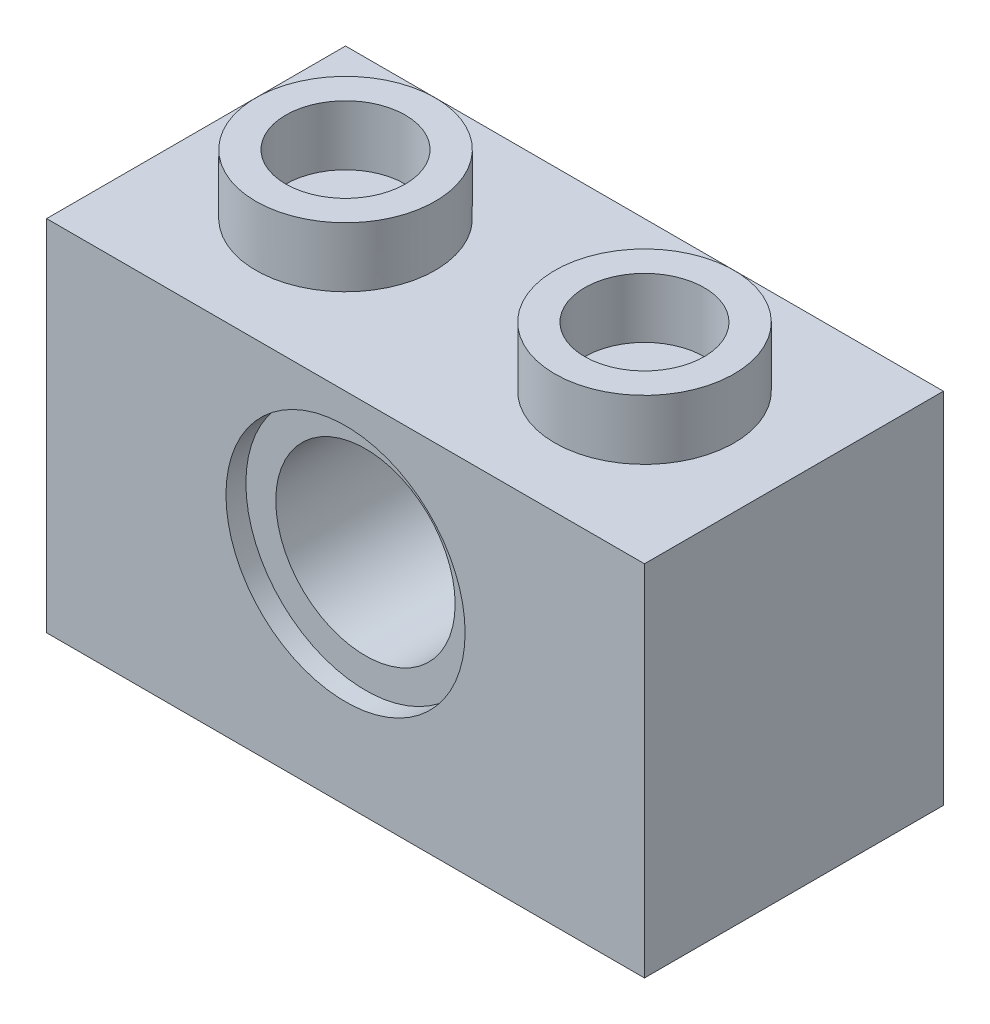
ISO-10303-21;
HEADER;
FILE_DESCRIPTION(('STEP AP214'),'2;1');
FILE_NAME('part.step','',(''),(''),'','','');
FILE_SCHEMA(('AUTOMOTIVE_DESIGN { 1 0 10303 214 1 1 1 1 }'));
ENDSEC;
DATA;
#1=APPLICATION_CONTEXT('core data for automotive mechanical design processes');
#2=APPLICATION_PROTOCOL_DEFINITION('international standard','automotive_design',2000,#1);
#3=PRODUCT_CONTEXT('',#1,'mechanical');
#4=PRODUCT('Part','Part','',(#3));
#5=PRODUCT_RELATED_PRODUCT_CATEGORY('part','',(#4));
#6=PRODUCT_DEFINITION_FORMATION('','',#4);
#7=PRODUCT_DEFINITION_CONTEXT('part definition',#1,'design');
#8=PRODUCT_DEFINITION('design','',#6,#7);
#9=PRODUCT_DEFINITION_SHAPE('','',#8);
#10=(LENGTH_UNIT() NAMED_UNIT(*) SI_UNIT(.MILLI.,.METRE.));
#11=(NAMED_UNIT(*) PLANE_ANGLE_UNIT() SI_UNIT($,.RADIAN.));
#12=(NAMED_UNIT(*) SI_UNIT($,.STERADIAN.) SOLID_ANGLE_UNIT());
#13=UNCERTAINTY_MEASURE_WITH_UNIT(LENGTH_MEASURE(1.E-05),#10,'distance_accuracy_value','');
#14=(GEOMETRIC_REPRESENTATION_CONTEXT(3) GLOBAL_UNCERTAINTY_ASSIGNED_CONTEXT((#13)) GLOBAL_UNIT_ASSIGNED_CONTEXT((#10,
#11,#12)) REPRESENTATION_CONTEXT('',''));
#15=CARTESIAN_POINT('',(0.,0.,0.));
#16=DIRECTION('',(0.,0.,1.));
#17=DIRECTION('',(1.,0.,0.));
#18=AXIS2_PLACEMENT_3D('',#15,#16,#17);
#19=CARTESIAN_POINT('',(5.,3.5,4.24264068711929));
#20=DIRECTION('',(0.,0.,-1.));
#21=DIRECTION('',(-1.,0.,0.));
#22=AXIS2_PLACEMENT_3D('',#19,#20,#21);
#23=CYLINDRICAL_SURFACE('',#22,1.5);
#24=CARTESIAN_POINT('',(5.,3.5,-4.66666666666667));
#25=DIRECTION('',(0.,0.,-1.));
#26=DIRECTION('',(-1.,0.,0.));
#27=AXIS2_PLACEMENT_3D('',#24,#25,#26);
#28=CIRCLE('',#27,1.5);
#29=CARTESIAN_POINT('',(3.5,3.5,-4.66666666666667));
#30=VERTEX_POINT('',#29);
#31=EDGE_CURVE('E192',#30,#30,#28,.T.);
#32=ORIENTED_EDGE('',*,*,#31,.T.);
#33=EDGE_LOOP('',(#32));
#34=FACE_BOUND('',#33,.T.);
#35=CARTESIAN_POINT('',(5.,3.5,-0.333333333333333));
#36=DIRECTION('',(0.,0.,1.));
#37=DIRECTION('',(1.,0.,0.));
#38=AXIS2_PLACEMENT_3D('',#35,#36,#37);
#39=CIRCLE('',#38,1.5);
#40=CARTESIAN_POINT('',(6.5,3.5,-0.333333333333333));
#41=VERTEX_POINT('',#40);
#42=EDGE_CURVE('E39',#41,#41,#39,.F.);
#43=ORIENTED_EDGE('',*,*,#42,.F.);
#44=EDGE_LOOP('',(#43));
#45=FACE_BOUND('',#44,.T.);
#46=ADVANCED_FACE('F35',(#34,#45),#23,.F.);
#47=CARTESIAN_POINT('',(500000.,5.,-4.));
#48=DIRECTION('',(0.,1.,0.));
#49=DIRECTION('',(0.,0.,1.));
#50=AXIS2_PLACEMENT_3D('',#47,#48,#49);
#51=PLANE('',#50);
#52=DIRECTION('',(-1.,0.,0.));
#53=VECTOR('',#52,1.);
#54=CARTESIAN_POINT('',(500000.,5.,-1.));
#55=LINE('',#54,#53);
#56=CARTESIAN_POINT('',(9.00000000001455,5.,-1.));
#57=VERTEX_POINT('',#56);
#58=CARTESIAN_POINT('',(6.3228756555323,5.,-1.));
#59=VERTEX_POINT('',#58);
#60=EDGE_CURVE('E129',#57,#59,#55,.T.);
#61=ORIENTED_EDGE('',*,*,#60,.T.);
#62=DIRECTION('',(0.,0.,-1.));
#63=VECTOR('',#62,1.);
#64=CARTESIAN_POINT('',(6.3228756555323,5.,5.65685424949238));
#65=LINE('',#64,#63);
#66=CARTESIAN_POINT('',(6.3228756555323,5.,-4.));
#67=VERTEX_POINT('',#66);
#68=EDGE_CURVE('E244',#59,#67,#65,.T.);
#69=ORIENTED_EDGE('',*,*,#68,.T.);
#70=DIRECTION('',(-1.,0.,0.));
#71=VECTOR('',#70,1.);
#72=CARTESIAN_POINT('',(500000.,5.,-4.));
#73=LINE('',#72,#71);
#74=CARTESIAN_POINT('',(9.00000000001455,5.,-4.));
#75=VERTEX_POINT('',#74);
#76=EDGE_CURVE('E123',#75,#67,#73,.T.);
#77=ORIENTED_EDGE('',*,*,#76,.F.);
#78=DIRECTION('',(0.,0.,1.));
#79=VECTOR('',#78,1.);
#80=CARTESIAN_POINT('',(9.00000000001455,5.,-4.));
#81=LINE('',#80,#79);
#82=EDGE_CURVE('E267',#75,#57,#81,.T.);
#83=ORIENTED_EDGE('',*,*,#82,.T.);
#84=EDGE_LOOP('',(#61,#69,#77,#83));
#85=FACE_BOUND('',#84,.T.);
#86=ADVANCED_FACE('F204',(#85),#51,.F.);
#87=CARTESIAN_POINT('',(0.,6.,0.));
#88=DIRECTION('',(0.,-1.,0.));
#89=DIRECTION('',(0.,0.,-1.));
#90=AXIS2_PLACEMENT_3D('',#87,#88,#89);
#91=PLANE('',#90);
#92=DIRECTION('',(0.,0.,1.));
#93=VECTOR('',#92,1.);
#94=CARTESIAN_POINT('',(0.,6.,0.));
#95=LINE('',#94,#93);
#96=CARTESIAN_POINT('',(0.,6.,-5.));
#97=VERTEX_POINT('',#96);
#98=CARTESIAN_POINT('',(0.,6.,0.));
#99=VERTEX_POINT('',#98);
#100=EDGE_CURVE('E157',#97,#99,#95,.T.);
#101=ORIENTED_EDGE('',*,*,#100,.T.);
#102=DIRECTION('',(1.,0.,0.));
#103=VECTOR('',#102,1.);
#104=CARTESIAN_POINT('',(0.,6.,0.));
#105=LINE('',#104,#103);
#106=CARTESIAN_POINT('',(10.,6.,0.));
#107=VERTEX_POINT('',#106);
#108=EDGE_CURVE('E160',#99,#107,#105,.T.);
#109=ORIENTED_EDGE('',*,*,#108,.T.);
#110=DIRECTION('',(0.,0.,-1.));
#111=VECTOR('',#110,1.);
#112=CARTESIAN_POINT('',(10.,6.,0.));
#113=LINE('',#112,#111);
#114=CARTESIAN_POINT('',(10.,6.,-5.));
#115=VERTEX_POINT('',#114);
#116=EDGE_CURVE('E163',#107,#115,#113,.T.);
#117=ORIENTED_EDGE('',*,*,#116,.T.);
#118=DIRECTION('',(-1.,0.,0.));
#119=VECTOR('',#118,1.);
#120=CARTESIAN_POINT('',(0.,6.,-5.));
#121=LINE('',#120,#119);
#122=EDGE_CURVE('E165',#115,#97,#121,.T.);
#123=ORIENTED_EDGE('',*,*,#122,.T.);
#124=EDGE_LOOP('',(#101,#109,#117,#123));
#125=FACE_BOUND('',#124,.T.);
#126=CARTESIAN_POINT('',(2.5,6.,-2.5));
#127=DIRECTION('',(0.,-1.,0.));
#128=DIRECTION('',(0.,0.,-1.));
#129=AXIS2_PLACEMENT_3D('',#126,#127,#128);
#130=CIRCLE('',#129,1.5);
#131=CARTESIAN_POINT('',(2.5,6.,-4.));
#132=VERTEX_POINT('',#131);
#133=EDGE_CURVE('E44',#132,#132,#130,.F.);
#134=ORIENTED_EDGE('',*,*,#133,.F.);
#135=EDGE_LOOP('',(#134));
#136=FACE_BOUND('',#135,.T.);
#137=CARTESIAN_POINT('',(7.5,6.,-2.5));
#138=DIRECTION('',(0.,1.,0.));
#139=DIRECTION('',(0.,0.,1.));
#140=AXIS2_PLACEMENT_3D('',#137,#138,#139);
#141=CIRCLE('',#140,1.5);
#142=CARTESIAN_POINT('',(7.5,6.,-1.));
#143=VERTEX_POINT('',#142);
#144=EDGE_CURVE('E249',#143,#143,#141,.F.);
#145=ORIENTED_EDGE('',*,*,#144,.T.);
#146=EDGE_LOOP('',(#145));
#147=FACE_BOUND('',#146,.T.);
#148=ADVANCED_FACE('F297',(#125,#136,#147),#91,.F.);
#149=CARTESIAN_POINT('',(1.,6.,-4.));
#150=DIRECTION('',(1.,0.,0.));
#151=DIRECTION('',(0.,0.,-1.));
#152=AXIS2_PLACEMENT_3D('',#149,#150,#151);
#153=PLANE('',#152);
#154=DIRECTION('',(0.,-1.,0.));
#155=VECTOR('',#154,1.);
#156=CARTESIAN_POINT('',(1.,6.,-4.));
#157=LINE('',#156,#155);
#158=CARTESIAN_POINT('',(1.,5.,-4.));
#159=VERTEX_POINT('',#158);
#160=CARTESIAN_POINT('',(1.,0.,-4.));
#161=VERTEX_POINT('',#160);
#162=EDGE_CURVE('E148',#159,#161,#157,.T.);
#163=ORIENTED_EDGE('',*,*,#162,.F.);
#164=DIRECTION('',(0.,0.,-1.));
#165=VECTOR('',#164,1.);
#166=CARTESIAN_POINT('',(1.,5.,-4.));
#167=LINE('',#166,#165);
#168=CARTESIAN_POINT('',(1.,5.,-1.));
#169=VERTEX_POINT('',#168);
#170=EDGE_CURVE('E127',#169,#159,#167,.T.);
#171=ORIENTED_EDGE('',*,*,#170,.F.);
#172=DIRECTION('',(0.,-1.,0.));
#173=VECTOR('',#172,1.);
#174=CARTESIAN_POINT('',(1.,6.,-1.));
#175=LINE('',#174,#173);
#176=CARTESIAN_POINT('',(1.,0.,-1.));
#177=VERTEX_POINT('',#176);
#178=EDGE_CURVE('E154',#169,#177,#175,.T.);
#179=ORIENTED_EDGE('',*,*,#178,.T.);
#180=DIRECTION('',(0.,0.,1.));
#181=VECTOR('',#180,1.);
#182=CARTESIAN_POINT('',(1.,0.,-4.));
#183=LINE('',#182,#181);
#184=EDGE_CURVE('E136',#161,#177,#183,.T.);
#185=ORIENTED_EDGE('',*,*,#184,.F.);
#186=EDGE_LOOP('',(#163,#171,#179,#185));
#187=FACE_BOUND('',#186,.T.);
#188=ADVANCED_FACE('F274',(#187),#153,.T.);
#189=CARTESIAN_POINT('',(1.,6.,-1.));
#190=DIRECTION('',(0.,0.,-1.));
#191=DIRECTION('',(-1.,0.,0.));
#192=AXIS2_PLACEMENT_3D('',#189,#190,#191);
#193=PLANE('',#192);
#194=CARTESIAN_POINT('',(5.,3.5,-1.));
#195=DIRECTION('',(0.,0.,-1.));
#196=DIRECTION('',(-1.,0.,0.));
#197=AXIS2_PLACEMENT_3D('',#194,#195,#196);
#198=CIRCLE('',#197,2.);
#199=CARTESIAN_POINT('',(3.67712434444911,5.,-1.));
#200=VERTEX_POINT('',#199);
#201=EDGE_CURVE('E52',#59,#200,#198,.T.);
#202=ORIENTED_EDGE('',*,*,#201,.F.);
#203=ORIENTED_EDGE('',*,*,#60,.F.);
#204=DIRECTION('',(0.,-1.,0.));
#205=VECTOR('',#204,1.);
#206=CARTESIAN_POINT('',(9.,6.,-1.));
#207=LINE('',#206,#205);
#208=CARTESIAN_POINT('',(9.,0.,-1.));
#209=VERTEX_POINT('',#208);
#210=EDGE_CURVE('E152',#57,#209,#207,.T.);
#211=ORIENTED_EDGE('',*,*,#210,.T.);
#212=DIRECTION('',(1.,0.,0.));
#213=VECTOR('',#212,1.);
#214=CARTESIAN_POINT('',(1.,0.,-1.));
#215=LINE('',#214,#213);
#216=EDGE_CURVE('E139',#177,#209,#215,.T.);
#217=ORIENTED_EDGE('',*,*,#216,.F.);
#218=ORIENTED_EDGE('',*,*,#178,.F.);
#219=EDGE_CURVE('E132',#200,#169,#55,.T.);
#220=ORIENTED_EDGE('',*,*,#219,.F.);
#221=EDGE_LOOP('',(#202,#203,#211,#217,#218,#220));
#222=FACE_BOUND('',#221,.T.);
#223=ADVANCED_FACE('F277',(#222),#193,.T.);
#224=CARTESIAN_POINT('',(9.,6.,-4.));
#225=DIRECTION('',(-1.,0.,0.));
#226=DIRECTION('',(0.,0.,1.));
#227=AXIS2_PLACEMENT_3D('',#224,#225,#226);
#228=PLANE('',#227);
#229=ORIENTED_EDGE('',*,*,#210,.F.);
#230=ORIENTED_EDGE('',*,*,#82,.F.);
#231=DIRECTION('',(0.,-1.,0.));
#232=VECTOR('',#231,1.);
#233=CARTESIAN_POINT('',(9.,6.,-4.));
#234=LINE('',#233,#232);
#235=CARTESIAN_POINT('',(9.,0.,-4.));
#236=VERTEX_POINT('',#235);
#237=EDGE_CURVE('E150',#75,#236,#234,.T.);
#238=ORIENTED_EDGE('',*,*,#237,.T.);
#239=DIRECTION('',(0.,0.,-1.));
#240=VECTOR('',#239,1.);
#241=CARTESIAN_POINT('',(9.,0.,-4.));
#242=LINE('',#241,#240);
#243=EDGE_CURVE('E142',#209,#236,#242,.T.);
#244=ORIENTED_EDGE('',*,*,#243,.F.);
#245=EDGE_LOOP('',(#229,#230,#238,#244));
#246=FACE_BOUND('',#245,.T.);
#247=ADVANCED_FACE('F284',(#246),#228,.T.);
#248=CARTESIAN_POINT('',(1.,6.,-4.));
#249=DIRECTION('',(0.,0.,1.));
#250=DIRECTION('',(1.,0.,0.));
#251=AXIS2_PLACEMENT_3D('',#248,#249,#250);
#252=PLANE('',#251);
#253=CARTESIAN_POINT('',(5.,3.5,-4.));
#254=DIRECTION('',(0.,0.,1.));
#255=DIRECTION('',(1.,0.,0.));
#256=AXIS2_PLACEMENT_3D('',#253,#254,#255);
#257=CIRCLE('',#256,2.);
#258=CARTESIAN_POINT('',(3.6771243444677,5.,-4.));
#259=VERTEX_POINT('',#258);
#260=EDGE_CURVE('E114',#259,#67,#257,.T.);
#261=ORIENTED_EDGE('',*,*,#260,.F.);
#262=EDGE_CURVE('E60',#259,#159,#73,.T.);
#263=ORIENTED_EDGE('',*,*,#262,.T.);
#264=ORIENTED_EDGE('',*,*,#162,.T.);
#265=DIRECTION('',(-1.,0.,0.));
#266=VECTOR('',#265,1.);
#267=CARTESIAN_POINT('',(1.,0.,-4.));
#268=LINE('',#267,#266);
#269=EDGE_CURVE('E145',#236,#161,#268,.T.);
#270=ORIENTED_EDGE('',*,*,#269,.F.);
#271=ORIENTED_EDGE('',*,*,#237,.F.);
#272=ORIENTED_EDGE('',*,*,#76,.T.);
#273=EDGE_LOOP('',(#261,#263,#264,#270,#271,#272));
#274=FACE_BOUND('',#273,.T.);
#275=ADVANCED_FACE('F121',(#274),#252,.T.);
#276=CARTESIAN_POINT('',(0.,0.,0.));
#277=DIRECTION('',(0.,-1.,0.));
#278=DIRECTION('',(0.,0.,-1.));
#279=AXIS2_PLACEMENT_3D('',#276,#277,#278);
#280=PLANE('',#279);
#281=DIRECTION('',(0.,0.,1.));
#282=VECTOR('',#281,1.);
#283=CARTESIAN_POINT('',(0.,0.,0.));
#284=LINE('',#283,#282);
#285=CARTESIAN_POINT('',(0.,0.,-5.));
#286=VERTEX_POINT('',#285);
#287=CARTESIAN_POINT('',(0.,0.,0.));
#288=VERTEX_POINT('',#287);
#289=EDGE_CURVE('E156',#286,#288,#284,.T.);
#290=ORIENTED_EDGE('',*,*,#289,.F.);
#291=DIRECTION('',(-1.,0.,0.));
#292=VECTOR('',#291,1.);
#293=CARTESIAN_POINT('',(0.,0.,-5.));
#294=LINE('',#293,#292);
#295=CARTESIAN_POINT('',(10.,0.,-5.));
#296=VERTEX_POINT('',#295);
#297=EDGE_CURVE('E161',#296,#286,#294,.T.);
#298=ORIENTED_EDGE('',*,*,#297,.F.);
#299=DIRECTION('',(0.,0.,-1.));
#300=VECTOR('',#299,1.);
#301=CARTESIAN_POINT('',(10.,0.,0.));
#302=LINE('',#301,#300);
#303=CARTESIAN_POINT('',(10.,0.,0.));
#304=VERTEX_POINT('',#303);
#305=EDGE_CURVE('E172',#304,#296,#302,.T.);
#306=ORIENTED_EDGE('',*,*,#305,.F.);
#307=DIRECTION('',(1.,0.,0.));
#308=VECTOR('',#307,1.);
#309=CARTESIAN_POINT('',(0.,0.,0.));
#310=LINE('',#309,#308);
#311=EDGE_CURVE('E170',#288,#304,#310,.T.);
#312=ORIENTED_EDGE('',*,*,#311,.F.);
#313=EDGE_LOOP('',(#290,#298,#306,#312));
#314=FACE_BOUND('',#313,.T.);
#315=ORIENTED_EDGE('',*,*,#269,.T.);
#316=ORIENTED_EDGE('',*,*,#184,.T.);
#317=ORIENTED_EDGE('',*,*,#216,.T.);
#318=ORIENTED_EDGE('',*,*,#243,.T.);
#319=EDGE_LOOP('',(#315,#316,#317,#318));
#320=FACE_BOUND('',#319,.T.);
#321=ADVANCED_FACE('F281',(#314,#320),#280,.T.);
#322=CARTESIAN_POINT('',(0.,6.,0.));
#323=DIRECTION('',(1.,0.,0.));
#324=DIRECTION('',(0.,0.,-1.));
#325=AXIS2_PLACEMENT_3D('',#322,#323,#324);
#326=PLANE('',#325);
#327=ORIENTED_EDGE('',*,*,#289,.T.);
#328=DIRECTION('',(0.,-1.,0.));
#329=VECTOR('',#328,1.);
#330=CARTESIAN_POINT('',(0.,6.,0.));
#331=LINE('',#330,#329);
#332=EDGE_CURVE('E183',#99,#288,#331,.T.);
#333=ORIENTED_EDGE('',*,*,#332,.F.);
#334=ORIENTED_EDGE('',*,*,#100,.F.);
#335=DIRECTION('',(0.,-1.,0.));
#336=VECTOR('',#335,1.);
#337=CARTESIAN_POINT('',(0.,6.,-5.));
#338=LINE('',#337,#336);
#339=EDGE_CURVE('E167',#97,#286,#338,.T.);
#340=ORIENTED_EDGE('',*,*,#339,.T.);
#341=EDGE_LOOP('',(#327,#333,#334,#340));
#342=FACE_BOUND('',#341,.T.);
#343=ADVANCED_FACE('F37',(#342),#326,.F.);
#344=CARTESIAN_POINT('',(0.,6.,0.));
#345=DIRECTION('',(0.,0.,-1.));
#346=DIRECTION('',(-1.,0.,0.));
#347=AXIS2_PLACEMENT_3D('',#344,#345,#346);
#348=PLANE('',#347);
#349=CARTESIAN_POINT('',(5.,3.5,0.));
#350=DIRECTION('',(0.,0.,1.));
#351=DIRECTION('',(1.,0.,0.));
#352=AXIS2_PLACEMENT_3D('',#349,#350,#351);
#353=CIRCLE('',#352,2.);
#354=CARTESIAN_POINT('',(7.,3.5,0.));
#355=VERTEX_POINT('',#354);
#356=EDGE_CURVE('E234',#355,#355,#353,.T.);
#357=ORIENTED_EDGE('',*,*,#356,.F.);
#358=EDGE_LOOP('',(#357));
#359=FACE_BOUND('',#358,.T.);
#360=ORIENTED_EDGE('',*,*,#311,.T.);
#361=DIRECTION('',(0.,-1.,0.));
#362=VECTOR('',#361,1.);
#363=CARTESIAN_POINT('',(10.,6.,0.));
#364=LINE('',#363,#362);
#365=EDGE_CURVE('E180',#107,#304,#364,.T.);
#366=ORIENTED_EDGE('',*,*,#365,.F.);
#367=ORIENTED_EDGE('',*,*,#108,.F.);
#368=ORIENTED_EDGE('',*,*,#332,.T.);
#369=EDGE_LOOP('',(#360,#366,#367,#368));
#370=FACE_BOUND('',#369,.T.);
#371=ADVANCED_FACE('F311',(#359,#370),#348,.F.);
#372=CARTESIAN_POINT('',(10.,6.,0.));
#373=DIRECTION('',(-1.,0.,0.));
#374=DIRECTION('',(0.,0.,1.));
#375=AXIS2_PLACEMENT_3D('',#372,#373,#374);
#376=PLANE('',#375);
#377=ORIENTED_EDGE('',*,*,#305,.T.);
#378=DIRECTION('',(0.,-1.,0.));
#379=VECTOR('',#378,1.);
#380=CARTESIAN_POINT('',(10.,6.,-5.));
#381=LINE('',#380,#379);
#382=EDGE_CURVE('E177',#115,#296,#381,.T.);
#383=ORIENTED_EDGE('',*,*,#382,.F.);
#384=ORIENTED_EDGE('',*,*,#116,.F.);
#385=ORIENTED_EDGE('',*,*,#365,.T.);
#386=EDGE_LOOP('',(#377,#383,#384,#385));
#387=FACE_BOUND('',#386,.T.);
#388=ADVANCED_FACE('F308',(#387),#376,.F.);
#389=CARTESIAN_POINT('',(0.,6.,-5.));
#390=DIRECTION('',(0.,0.,1.));
#391=DIRECTION('',(1.,0.,0.));
#392=AXIS2_PLACEMENT_3D('',#389,#390,#391);
#393=PLANE('',#392);
#394=CARTESIAN_POINT('',(5.,3.5,-5.));
#395=DIRECTION('',(0.,0.,-1.));
#396=DIRECTION('',(-1.,0.,0.));
#397=AXIS2_PLACEMENT_3D('',#394,#395,#396);
#398=CIRCLE('',#397,2.);
#399=CARTESIAN_POINT('',(3.,3.5,-5.));
#400=VERTEX_POINT('',#399);
#401=EDGE_CURVE('E230',#400,#400,#398,.T.);
#402=ORIENTED_EDGE('',*,*,#401,.F.);
#403=EDGE_LOOP('',(#402));
#404=FACE_BOUND('',#403,.T.);
#405=ORIENTED_EDGE('',*,*,#297,.T.);
#406=ORIENTED_EDGE('',*,*,#339,.F.);
#407=ORIENTED_EDGE('',*,*,#122,.F.);
#408=ORIENTED_EDGE('',*,*,#382,.T.);
#409=EDGE_LOOP('',(#405,#406,#407,#408));
#410=FACE_BOUND('',#409,.T.);
#411=ADVANCED_FACE('F305',(#404,#410),#393,.F.);
#412=ORIENTED_EDGE('',*,*,#262,.F.);
#413=DIRECTION('',(0.,0.,-1.));
#414=VECTOR('',#413,1.);
#415=CARTESIAN_POINT('',(3.6771243444677,5.,5.65685424949238));
#416=LINE('',#415,#414);
#417=EDGE_CURVE('E112',#259,#200,#416,.F.);
#418=ORIENTED_EDGE('',*,*,#417,.T.);
#419=ORIENTED_EDGE('',*,*,#219,.T.);
#420=ORIENTED_EDGE('',*,*,#170,.T.);
#421=EDGE_LOOP('',(#412,#418,#419,#420));
#422=FACE_BOUND('',#421,.T.);
#423=ADVANCED_FACE('F125',(#422),#51,.F.);
#424=CARTESIAN_POINT('',(2.5,7.,-2.5));
#425=DIRECTION('',(0.,-1.,0.));
#426=DIRECTION('',(0.,0.,-1.));
#427=AXIS2_PLACEMENT_3D('',#424,#425,#426);
#428=CYLINDRICAL_SURFACE('',#427,1.);
#429=CARTESIAN_POINT('',(2.5,7.,-2.5));
#430=DIRECTION('',(0.,1.,0.));
#431=DIRECTION('',(0.,0.,1.));
#432=AXIS2_PLACEMENT_3D('',#429,#430,#431);
#433=CIRCLE('',#432,1.);
#434=CARTESIAN_POINT('',(2.5,7.,-1.5));
#435=VERTEX_POINT('',#434);
#436=EDGE_CURVE('E257',#435,#435,#433,.F.);
#437=ORIENTED_EDGE('',*,*,#436,.F.);
#438=EDGE_LOOP('',(#437));
#439=FACE_BOUND('',#438,.T.);
#440=CARTESIAN_POINT('',(2.5,6.,-2.5));
#441=DIRECTION('',(0.,-1.,0.));
#442=DIRECTION('',(0.,0.,-1.));
#443=AXIS2_PLACEMENT_3D('',#440,#441,#442);
#444=CIRCLE('',#443,1.);
#445=CARTESIAN_POINT('',(2.5,6.,-3.5));
#446=VERTEX_POINT('',#445);
#447=EDGE_CURVE('E11',#446,#446,#444,.T.);
#448=ORIENTED_EDGE('',*,*,#447,.T.);
#449=EDGE_LOOP('',(#448));
#450=FACE_BOUND('',#449,.T.);
#451=ADVANCED_FACE('F359',(#439,#450),#428,.F.);
#452=CARTESIAN_POINT('',(2.5,7.,-2.5));
#453=DIRECTION('',(0.,-1.,0.));
#454=DIRECTION('',(0.,0.,-1.));
#455=AXIS2_PLACEMENT_3D('',#452,#453,#454);
#456=CYLINDRICAL_SURFACE('',#455,1.5);
#457=CARTESIAN_POINT('',(2.5,7.,-2.5));
#458=DIRECTION('',(0.,1.,0.));
#459=DIRECTION('',(0.,0.,1.));
#460=AXIS2_PLACEMENT_3D('',#457,#458,#459);
#461=CIRCLE('',#460,1.5);
#462=CARTESIAN_POINT('',(2.5,7.,-1.));
#463=VERTEX_POINT('',#462);
#464=EDGE_CURVE('E264',#463,#463,#461,.T.);
#465=ORIENTED_EDGE('',*,*,#464,.F.);
#466=EDGE_LOOP('',(#465));
#467=FACE_BOUND('',#466,.T.);
#468=ORIENTED_EDGE('',*,*,#133,.T.);
#469=EDGE_LOOP('',(#468));
#470=FACE_BOUND('',#469,.T.);
#471=ADVANCED_FACE('F355',(#467,#470),#456,.T.);
#472=CARTESIAN_POINT('',(0.,7.,0.));
#473=DIRECTION('',(0.,1.,0.));
#474=DIRECTION('',(0.,0.,1.));
#475=AXIS2_PLACEMENT_3D('',#472,#473,#474);
#476=PLANE('',#475);
#477=ORIENTED_EDGE('',*,*,#436,.T.);
#478=EDGE_LOOP('',(#477));
#479=FACE_BOUND('',#478,.T.);
#480=ORIENTED_EDGE('',*,*,#464,.T.);
#481=EDGE_LOOP('',(#480));
#482=FACE_BOUND('',#481,.T.);
#483=ADVANCED_FACE('F349',(#479,#482),#476,.T.);
#484=ORIENTED_EDGE('',*,*,#447,.F.);
#485=EDGE_LOOP('',(#484));
#486=FACE_BOUND('',#485,.T.);
#487=ADVANCED_FACE('F301',(#486),#91,.F.);
#488=CARTESIAN_POINT('',(7.5,7.,-2.5));
#489=DIRECTION('',(0.,-1.,0.));
#490=DIRECTION('',(0.,0.,-1.));
#491=AXIS2_PLACEMENT_3D('',#488,#489,#490);
#492=CYLINDRICAL_SURFACE('',#491,1.5);
#493=CARTESIAN_POINT('',(7.5,7.,-2.5));
#494=DIRECTION('',(0.,1.,0.));
#495=DIRECTION('',(0.,0.,1.));
#496=AXIS2_PLACEMENT_3D('',#493,#494,#495);
#497=CIRCLE('',#496,1.5);
#498=CARTESIAN_POINT('',(7.5,7.,-1.));
#499=VERTEX_POINT('',#498);
#500=EDGE_CURVE('E250',#499,#499,#497,.F.);
#501=ORIENTED_EDGE('',*,*,#500,.T.);
#502=EDGE_LOOP('',(#501));
#503=FACE_BOUND('',#502,.T.);
#504=ORIENTED_EDGE('',*,*,#144,.F.);
#505=EDGE_LOOP('',(#504));
#506=FACE_BOUND('',#505,.T.);
#507=ADVANCED_FACE('F337',(#503,#506),#492,.T.);
#508=CARTESIAN_POINT('',(7.5,7.,-2.5));
#509=DIRECTION('',(0.,-1.,0.));
#510=DIRECTION('',(0.,0.,-1.));
#511=AXIS2_PLACEMENT_3D('',#508,#509,#510);
#512=CYLINDRICAL_SURFACE('',#511,1.);
#513=CARTESIAN_POINT('',(7.5,7.,-2.5));
#514=DIRECTION('',(0.,1.,0.));
#515=DIRECTION('',(0.,0.,1.));
#516=AXIS2_PLACEMENT_3D('',#513,#514,#515);
#517=CIRCLE('',#516,1.);
#518=CARTESIAN_POINT('',(7.5,7.,-1.5));
#519=VERTEX_POINT('',#518);
#520=EDGE_CURVE('E253',#519,#519,#517,.T.);
#521=ORIENTED_EDGE('',*,*,#520,.T.);
#522=EDGE_LOOP('',(#521));
#523=FACE_BOUND('',#522,.T.);
#524=CARTESIAN_POINT('',(7.5,6.,-2.5));
#525=DIRECTION('',(0.,1.,0.));
#526=DIRECTION('',(0.,0.,1.));
#527=AXIS2_PLACEMENT_3D('',#524,#525,#526);
#528=CIRCLE('',#527,1.);
#529=CARTESIAN_POINT('',(7.5,6.,-1.5));
#530=VERTEX_POINT('',#529);
#531=EDGE_CURVE('E254',#530,#530,#528,.T.);
#532=ORIENTED_EDGE('',*,*,#531,.F.);
#533=EDGE_LOOP('',(#532));
#534=FACE_BOUND('',#533,.T.);
#535=ADVANCED_FACE('F339',(#523,#534),#512,.F.);
#536=CARTESIAN_POINT('',(0.,7.,0.));
#537=DIRECTION('',(0.,1.,0.));
#538=DIRECTION('',(0.,0.,1.));
#539=AXIS2_PLACEMENT_3D('',#536,#537,#538);
#540=PLANE('',#539);
#541=ORIENTED_EDGE('',*,*,#500,.F.);
#542=EDGE_LOOP('',(#541));
#543=FACE_BOUND('',#542,.T.);
#544=ORIENTED_EDGE('',*,*,#520,.F.);
#545=EDGE_LOOP('',(#544));
#546=FACE_BOUND('',#545,.T.);
#547=ADVANCED_FACE('F346',(#543,#546),#540,.T.);
#548=ORIENTED_EDGE('',*,*,#531,.T.);
#549=EDGE_LOOP('',(#548));
#550=FACE_BOUND('',#549,.T.);
#551=ADVANCED_FACE('F200',(#550),#91,.F.);
#552=CARTESIAN_POINT('',(5.,3.5,5.65685424949238));
#553=DIRECTION('',(0.,0.,-1.));
#554=DIRECTION('',(-1.,0.,0.));
#555=AXIS2_PLACEMENT_3D('',#552,#553,#554);
#556=CYLINDRICAL_SURFACE('',#555,2.);
#557=CARTESIAN_POINT('',(5.00000000000728,1.5,-1.50000000000727));
#558=CARTESIAN_POINT('',(4.94742803705468,1.5000028659583,-1.50000330232677));
#559=CARTESIAN_POINT('',(4.89479340031001,1.50209508980441,-1.50417007312891));
#560=CARTESIAN_POINT('',(4.79107976474034,1.51025843962513,-1.52065288034804));
#561=CARTESIAN_POINT('',(4.74000391329561,1.51633712170898,-1.53298439300469));
#562=CARTESIAN_POINT('',(4.64106645512919,1.53183720596511,-1.56519380862364));
#563=CARTESIAN_POINT('',(4.59319319707089,1.54124560822271,-1.58504238425473));
#564=CARTESIAN_POINT('',(4.50152738320409,1.56254223483948,-1.63157062137139));
#565=CARTESIAN_POINT('',(4.45773450602088,1.57443026366163,-1.65824974425515));
#566=CARTESIAN_POINT('',(4.37249218224961,1.60043741741563,-1.71951724949122));
#567=CARTESIAN_POINT('',(4.33134478888973,1.61464800872045,-1.75448647924533));
#568=CARTESIAN_POINT('',(4.25522055514545,1.64340029752758,-1.8305214792522));
#569=CARTESIAN_POINT('',(4.22024841690593,1.65794223790428,-1.87159185177732));
#570=CARTESIAN_POINT('',(4.15474799956298,1.68701048802036,-1.96248334952756));
#571=CARTESIAN_POINT('',(4.1247746644619,1.7014481302921,-2.01273609834965));
#572=CARTESIAN_POINT('',(4.07383177312331,1.72714021226948,-2.11836733598901));
#573=CARTESIAN_POINT('',(4.05285578504787,1.73839692392247,-2.17374212872503));
#574=CARTESIAN_POINT('',(4.02186755782585,1.75542132961382,-2.28466510542327));
#575=CARTESIAN_POINT('',(4.01127414293406,1.76147728415462,-2.34000445206833));
#576=CARTESIAN_POINT('',(3.99957300670572,1.76818110050631,-2.45197883777958));
#577=CARTESIAN_POINT('',(3.99845591164148,1.7688343065587,-2.50861254087083));
#578=CARTESIAN_POINT('',(4.0053127128422,1.76489069741921,-2.61428602431448));
#579=CARTESIAN_POINT('',(4.01221544047765,1.76091236337164,-2.66342403122202));
#580=CARTESIAN_POINT('',(4.03306015095752,1.74923771265352,-2.75972190937173));
#581=CARTESIAN_POINT('',(4.0470043761168,1.74154021167441,-2.80688114530387));
#582=CARTESIAN_POINT('',(4.08179021962844,1.72312523586512,-2.89922913256392));
#583=CARTESIAN_POINT('',(4.10278493289845,1.71234159335276,-2.94434639878389));
#584=CARTESIAN_POINT('',(4.15095831234646,1.68896595717919,-3.03063429258778));
#585=CARTESIAN_POINT('',(4.178139756202,1.67637315219157,-3.0718031355977));
#586=CARTESIAN_POINT('',(4.2419339451016,1.64886842096126,-3.15452125274032));
#587=CARTESIAN_POINT('',(4.27930554164498,1.63386489762704,-3.19545687357291));
#588=CARTESIAN_POINT('',(4.36044442127259,1.60452376699122,-3.270735418587));
#589=CARTESIAN_POINT('',(4.40421474343951,1.59018648040769,-3.30507519202966));
#590=CARTESIAN_POINT('',(4.49948349418142,1.56298012716695,-3.36768566102477));
#591=CARTESIAN_POINT('',(4.55124640841347,1.55021015837698,-3.39560047244039));
#592=CARTESIAN_POINT('',(4.65953378452321,1.52842118878552,-3.44209702903697));
#593=CARTESIAN_POINT('',(4.71605442374625,1.51939921056284,-3.46068618500882));
#594=CARTESIAN_POINT('',(4.82723350834987,1.50675666258474,-3.48647540370986));
#595=CARTESIAN_POINT('',(4.88165846946178,1.5027506169863,-3.49449123573978));
#596=CARTESIAN_POINT('',(4.99122040005977,1.49926986540895,-3.50146473112722));
#597=CARTESIAN_POINT('',(5.04635701987851,1.49979301278709,-3.50042668563212));
#598=CARTESIAN_POINT('',(5.15123297199374,1.50508807746619,-3.48979331157381));
#599=CARTESIAN_POINT('',(5.20105940805735,1.50952754311886,-3.48086746726251));
#600=CARTESIAN_POINT('',(5.29840689230861,1.52177828685283,-3.45576192809747));
#601=CARTESIAN_POINT('',(5.34592768569734,1.5295899366578,-3.43958143353923));
#602=CARTESIAN_POINT('',(5.43888860845537,1.54815748586459,-3.4000015335595));
#603=CARTESIAN_POINT('',(5.48423039701157,1.55899118230196,-3.3764089498759));
#604=CARTESIAN_POINT('',(5.57046136170377,1.58256025683036,-3.32289246434679));
#605=CARTESIAN_POINT('',(5.61134862977985,1.59529644434362,-3.29296586539947));
#606=CARTESIAN_POINT('',(5.69176768929464,1.62291778662683,-3.22423957466021));
#607=CARTESIAN_POINT('',(5.73077207782832,1.63789115151704,-3.18485713153963));
#608=CARTESIAN_POINT('',(5.80185632111632,1.66737608396261,-3.10007484872416));
#609=CARTESIAN_POINT('',(5.83393138569363,1.68188732618602,-3.05467088117723));
#610=CARTESIAN_POINT('',(5.89170791449984,1.7094880777404,-2.95635634579372));
#611=CARTESIAN_POINT('',(5.91702549588045,1.72247470336622,-2.90318873378574));
#612=CARTESIAN_POINT('',(5.958082826015,1.74425927631939,-2.79248993230246));
#613=CARTESIAN_POINT('',(5.97383491588848,1.75306261759433,-2.73496447349415));
#614=CARTESIAN_POINT('',(5.99386168745009,1.76438498991357,-2.6230897771347));
#615=CARTESIAN_POINT('',(5.99909299640107,1.76742616539521,-2.56896574656757));
#616=CARTESIAN_POINT('',(6.00068915438067,1.76834645353819,-2.46055293282683));
#617=CARTESIAN_POINT('',(5.99705784662417,1.76622780372434,-2.40626423125862));
#618=CARTESIAN_POINT('',(5.9819261255919,1.75762137949955,-2.30451649846691));
#619=CARTESIAN_POINT('',(5.9712083143424,1.75156905517584,-2.25689952985492));
#620=CARTESIAN_POINT('',(5.94317535822423,1.7362898381206,-2.16419188057539));
#621=CARTESIAN_POINT('',(5.92585809115941,1.72706192430304,-2.11910201790852));
#622=CARTESIAN_POINT('',(5.88381574530037,1.70571469635456,-2.02937514901462));
#623=CARTESIAN_POINT('',(5.8586711378162,1.69344277603797,-1.98497209817189));
#624=CARTESIAN_POINT('',(5.80215097163654,1.66764668365406,-1.90072546382171));
#625=CARTESIAN_POINT('',(5.77077217123866,1.65412186205479,-1.86088426948415));
#626=CARTESIAN_POINT('',(5.69820332666494,1.62537676840698,-1.78185801764575));
#627=CARTESIAN_POINT('',(5.65628442301066,1.61015016688549,-1.74334089764183));
#628=CARTESIAN_POINT('',(5.5661548062212,1.5812224774494,-1.67373701658084));
#629=CARTESIAN_POINT('',(5.51794072325795,1.56752221391992,-1.64265426057853));
#630=CARTESIAN_POINT('',(5.41593159682168,1.54301990414934,-1.58876363724327));
#631=CARTESIAN_POINT('',(5.36209950393665,1.5322390343713,-1.56601583059435));
#632=CARTESIAN_POINT('',(5.25074210129691,1.5149865863657,-1.53019183208739));
#633=CARTESIAN_POINT('',(5.19322779962625,1.50850276627099,-1.51708815317702));
#634=CARTESIAN_POINT('',(5.11260194648747,1.5030453809036,-1.50610258893112));
#635=CARTESIAN_POINT('',(5.09016187944422,1.5019063466082,-1.50381735914346));
#636=CARTESIAN_POINT('',(5.04515173181315,1.50038303022149,-1.50076533449043));
#637=CARTESIAN_POINT('',(5.02258164765402,1.49999876896245,-1.49999858153607));
#638=CARTESIAN_POINT('',(5.00000000000728,1.5,-1.50000000000727));
#639=B_SPLINE_CURVE_WITH_KNOTS('',3,(#557,#558,#559,#560,#561,#562,#563,#564,#565,#566,#567,
#568,#569,#570,#571,#572,#573,#574,#575,#576,#577,#578,#579,#580,#581,#582,#583,#584,#585,#586,
#587,#588,#589,#590,#591,#592,#593,#594,#595,#596,#597,#598,#599,#600,#601,#602,#603,#604,#605,
#606,#607,#608,#609,#610,#611,#612,#613,#614,#615,#616,#617,#618,#619,#620,#621,#622,#623,#624,
#625,#626,#627,#628,#629,#630,#631,#632,#633,#634,#635,#636,#637,#638),.UNSPECIFIED.,.T.,.F.,(4,
2,2,2,2,2,2,2,2,2,2,2,2,2,2,2,2,2,2,2,2,2,2,2,2,2,2,2,2,2,2,2,2,2,2,2,2,2,2,2,4),(0.,
0.157624257419139,0.315548149706891,0.472862155488854,0.630163760576985,0.796981758712072,
0.963926237646579,1.14381726429829,1.32357947897179,1.49258012139001,1.66141357327666,
1.81005712407921,1.95874803924234,2.11090240166985,2.26312521258663,2.43464941332193,
2.60625534596874,2.78583022212447,2.96526216910104,3.12983290469018,3.29432564508997,
3.44606906503546,3.59782921628258,3.7539285602515,3.91009450745515,4.08159610641506,
4.25321588612431,4.43314682156543,4.61284511937518,4.7752930749497,4.93767059856459,
5.08457930240527,5.23153528779913,5.38836456771748,5.5452756113499,5.72125242748413,
5.89732383372369,6.07464013658601,6.25144908620486,6.31915280133062,6.38685838510019),.UNSPECIFIED.);
#640=CARTESIAN_POINT('',(5.00000000000728,1.5,-1.50000000000727));
#641=VERTEX_POINT('',#640);
#642=EDGE_CURVE('E118',#641,#641,#639,.T.);
#643=ORIENTED_EDGE('',*,*,#642,.F.);
#644=EDGE_LOOP('',(#643));
#645=FACE_BOUND('',#644,.T.);
#646=ORIENTED_EDGE('',*,*,#68,.F.);
#647=ORIENTED_EDGE('',*,*,#201,.T.);
#648=ORIENTED_EDGE('',*,*,#417,.F.);
#649=ORIENTED_EDGE('',*,*,#260,.T.);
#650=EDGE_LOOP('',(#646,#647,#648,#649));
#651=FACE_BOUND('',#650,.T.);
#652=ADVANCED_FACE('F113',(#645,#651),#556,.T.);
#653=CARTESIAN_POINT('',(0.,0.,0.));
#654=DIRECTION('',(0.,-1.,0.));
#655=DIRECTION('',(0.,0.,-1.));
#656=AXIS2_PLACEMENT_3D('',#653,#654,#655);
#657=PLANE('',#656);
#658=CARTESIAN_POINT('',(5.00000000000728,0.,-2.5));
#659=DIRECTION('',(0.,-1.,0.));
#660=DIRECTION('',(0.,0.,-1.));
#661=AXIS2_PLACEMENT_3D('',#658,#659,#660);
#662=CIRCLE('',#661,0.999999999992729);
#663=CARTESIAN_POINT('',(5.00000000000728,0.,-3.49999999999273));
#664=VERTEX_POINT('',#663);
#665=EDGE_CURVE('E246',#664,#664,#662,.T.);
#666=ORIENTED_EDGE('',*,*,#665,.T.);
#667=EDGE_LOOP('',(#666));
#668=FACE_BOUND('',#667,.T.);
#669=ADVANCED_FACE('F199',(#668),#657,.T.);
#670=CARTESIAN_POINT('',(5.00000000000728,-2.82842712472562,-2.5));
#671=DIRECTION('',(0.,1.,0.));
#672=DIRECTION('',(0.,0.,1.));
#673=AXIS2_PLACEMENT_3D('',#670,#671,#672);
#674=CYLINDRICAL_SURFACE('',#673,0.999999999992729);
#675=ORIENTED_EDGE('',*,*,#642,.T.);
#676=EDGE_LOOP('',(#675));
#677=FACE_BOUND('',#676,.T.);
#678=ORIENTED_EDGE('',*,*,#665,.F.);
#679=EDGE_LOOP('',(#678));
#680=FACE_BOUND('',#679,.T.);
#681=ADVANCED_FACE('F193',(#677,#680),#674,.T.);
#682=CARTESIAN_POINT('',(5.,3.5,-4.66666666666667));
#683=DIRECTION('',(0.,0.,-1.));
#684=DIRECTION('',(-1.,0.,0.));
#685=AXIS2_PLACEMENT_3D('',#682,#683,#684);
#686=CYLINDRICAL_SURFACE('',#685,2.);
#687=CARTESIAN_POINT('',(5.,3.5,-4.66666666666667));
#688=DIRECTION('',(0.,0.,-1.));
#689=DIRECTION('',(-1.,0.,0.));
#690=AXIS2_PLACEMENT_3D('',#687,#688,#689);
#691=CIRCLE('',#690,2.);
#692=CARTESIAN_POINT('',(3.,3.5,-4.66666666666667));
#693=VERTEX_POINT('',#692);
#694=EDGE_CURVE('E232',#693,#693,#691,.T.);
#695=ORIENTED_EDGE('',*,*,#694,.F.);
#696=EDGE_LOOP('',(#695));
#697=FACE_BOUND('',#696,.T.);
#698=ORIENTED_EDGE('',*,*,#401,.T.);
#699=EDGE_LOOP('',(#698));
#700=FACE_BOUND('',#699,.T.);
#701=ADVANCED_FACE('F206',(#697,#700),#686,.F.);
#702=CARTESIAN_POINT('',(0.,0.,-4.66666666666667));
#703=DIRECTION('',(0.,0.,-1.));
#704=DIRECTION('',(-1.,0.,0.));
#705=AXIS2_PLACEMENT_3D('',#702,#703,#704);
#706=PLANE('',#705);
#707=ORIENTED_EDGE('',*,*,#694,.T.);
#708=EDGE_LOOP('',(#707));
#709=FACE_BOUND('',#708,.T.);
#710=ORIENTED_EDGE('',*,*,#31,.F.);
#711=EDGE_LOOP('',(#710));
#712=FACE_BOUND('',#711,.T.);
#713=ADVANCED_FACE('F209',(#709,#712),#706,.T.);
#714=CARTESIAN_POINT('',(5.,3.5,-0.333333333333333));
#715=DIRECTION('',(0.,0.,1.));
#716=DIRECTION('',(1.,0.,0.));
#717=AXIS2_PLACEMENT_3D('',#714,#715,#716);
#718=PLANE('',#717);
#719=CARTESIAN_POINT('',(5.,3.5,-0.333333333333333));
#720=DIRECTION('',(0.,0.,1.));
#721=DIRECTION('',(1.,0.,0.));
#722=AXIS2_PLACEMENT_3D('',#719,#720,#721);
#723=CIRCLE('',#722,2.);
#724=CARTESIAN_POINT('',(7.,3.5,-0.333333333333333));
#725=VERTEX_POINT('',#724);
#726=EDGE_CURVE('E226',#725,#725,#723,.T.);
#727=ORIENTED_EDGE('',*,*,#726,.T.);
#728=EDGE_LOOP('',(#727));
#729=FACE_BOUND('',#728,.T.);
#730=ORIENTED_EDGE('',*,*,#42,.T.);
#731=EDGE_LOOP('',(#730));
#732=FACE_BOUND('',#731,.T.);
#733=ADVANCED_FACE('F213',(#729,#732),#718,.T.);
#734=CARTESIAN_POINT('',(5.,3.5,-0.333333333333333));
#735=DIRECTION('',(0.,0.,1.));
#736=DIRECTION('',(1.,0.,0.));
#737=AXIS2_PLACEMENT_3D('',#734,#735,#736);
#738=CYLINDRICAL_SURFACE('',#737,2.);
#739=ORIENTED_EDGE('',*,*,#726,.F.);
#740=EDGE_LOOP('',(#739));
#741=FACE_BOUND('',#740,.T.);
#742=ORIENTED_EDGE('',*,*,#356,.T.);
#743=EDGE_LOOP('',(#742));
#744=FACE_BOUND('',#743,.T.);
#745=ADVANCED_FACE('F215',(#741,#744),#738,.F.);
#746=CLOSED_SHELL('',(#46,#86,#148,#188,#223,#247,#275,#321,#343,#371,#388,#411,#423,#451,#471,
#483,#487,#507,#535,#547,#551,#652,#669,#681,#701,#713,#733,#745));
#747=MANIFOLD_SOLID_BREP('B2',#746);
#748=ADVANCED_BREP_SHAPE_REPRESENTATION('',(#18,#747),#14);
#749=SHAPE_DEFINITION_REPRESENTATION(#9,#748);
ENDSEC;
END-ISO-10303-21;
